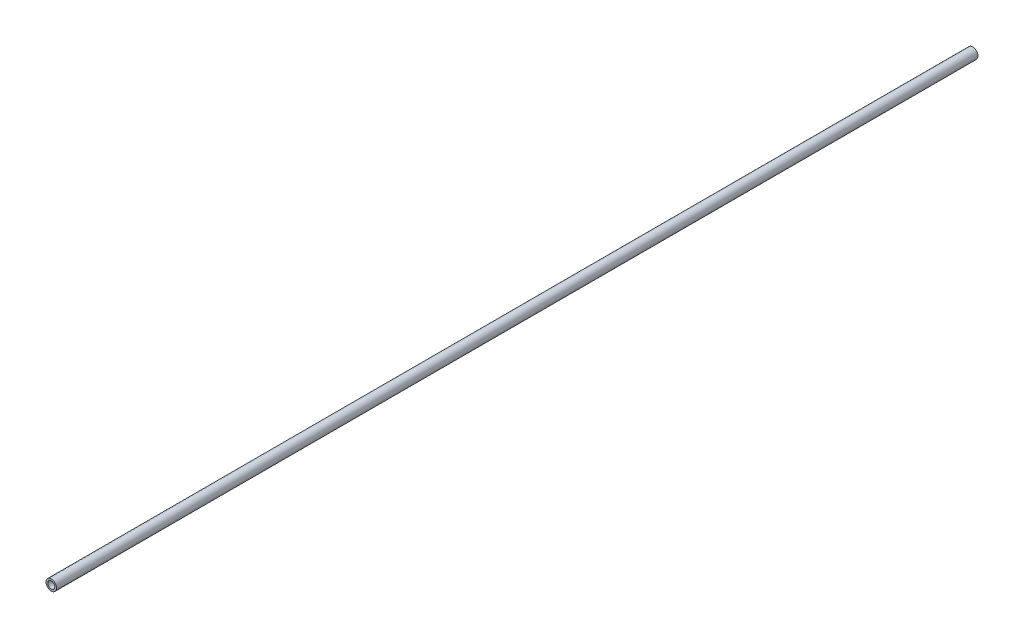
ISO-10303-21;
HEADER;
FILE_DESCRIPTION(('STEP AP214'),'2;1');
FILE_NAME('part.step','',(''),(''),'','','');
FILE_SCHEMA(('AUTOMOTIVE_DESIGN { 1 0 10303 214 1 1 1 1 }'));
ENDSEC;
DATA;
#1=APPLICATION_CONTEXT('core data for automotive mechanical design processes');
#2=APPLICATION_PROTOCOL_DEFINITION('international standard','automotive_design',2000,#1);
#3=PRODUCT_CONTEXT('',#1,'mechanical');
#4=PRODUCT('Part','Part','',(#3));
#5=PRODUCT_RELATED_PRODUCT_CATEGORY('part','',(#4));
#6=PRODUCT_DEFINITION_FORMATION('','',#4);
#7=PRODUCT_DEFINITION_CONTEXT('part definition',#1,'design');
#8=PRODUCT_DEFINITION('design','',#6,#7);
#9=PRODUCT_DEFINITION_SHAPE('','',#8);
#10=(LENGTH_UNIT() NAMED_UNIT(*) SI_UNIT(.MILLI.,.METRE.));
#11=(NAMED_UNIT(*) PLANE_ANGLE_UNIT() SI_UNIT($,.RADIAN.));
#12=(NAMED_UNIT(*) SI_UNIT($,.STERADIAN.) SOLID_ANGLE_UNIT());
#13=UNCERTAINTY_MEASURE_WITH_UNIT(LENGTH_MEASURE(1.E-05),#10,'distance_accuracy_value','');
#14=(GEOMETRIC_REPRESENTATION_CONTEXT(3) GLOBAL_UNCERTAINTY_ASSIGNED_CONTEXT((#13)) GLOBAL_UNIT_ASSIGNED_CONTEXT((#10,
#11,#12)) REPRESENTATION_CONTEXT('',''));
#15=CARTESIAN_POINT('',(0.,0.,0.));
#16=DIRECTION('',(0.,0.,1.));
#17=DIRECTION('',(1.,0.,0.));
#18=AXIS2_PLACEMENT_3D('',#15,#16,#17);
#19=CARTESIAN_POINT('',(0.,0.,1333.5));
#20=DIRECTION('',(0.,0.,1.));
#21=DIRECTION('',(1.,0.,0.));
#22=AXIS2_PLACEMENT_3D('',#19,#20,#21);
#23=PLANE('',#22);
#24=CARTESIAN_POINT('',(0.,0.,1333.5));
#25=DIRECTION('',(0.,0.,1.));
#26=DIRECTION('',(1.,0.,0.));
#27=AXIS2_PLACEMENT_3D('',#24,#25,#26);
#28=CIRCLE('',#27,7.62);
#29=CARTESIAN_POINT('',(7.62,0.,1333.5));
#30=VERTEX_POINT('',#29);
#31=EDGE_CURVE('E10',#30,#30,#28,.T.);
#32=ORIENTED_EDGE('',*,*,#31,.T.);
#33=EDGE_LOOP('',(#32));
#34=FACE_BOUND('',#33,.T.);
#35=CARTESIAN_POINT('',(0.,0.,1333.5));
#36=DIRECTION('',(0.,0.,1.));
#37=DIRECTION('',(1.,0.,0.));
#38=AXIS2_PLACEMENT_3D('',#35,#36,#37);
#39=CIRCLE('',#38,5.08);
#40=CARTESIAN_POINT('',(5.08,0.,1333.5));
#41=VERTEX_POINT('',#40);
#42=EDGE_CURVE('E43',#41,#41,#39,.T.);
#43=ORIENTED_EDGE('',*,*,#42,.F.);
#44=EDGE_LOOP('',(#43));
#45=FACE_BOUND('',#44,.T.);
#46=ADVANCED_FACE('F32',(#34,#45),#23,.T.);
#47=CARTESIAN_POINT('',(0.,0.,0.));
#48=DIRECTION('',(0.,0.,1.));
#49=DIRECTION('',(1.,0.,0.));
#50=AXIS2_PLACEMENT_3D('',#47,#48,#49);
#51=PLANE('',#50);
#52=CARTESIAN_POINT('',(0.,0.,0.));
#53=DIRECTION('',(0.,0.,1.));
#54=DIRECTION('',(1.,0.,0.));
#55=AXIS2_PLACEMENT_3D('',#52,#53,#54);
#56=CIRCLE('',#55,7.62);
#57=CARTESIAN_POINT('',(7.62,0.,0.));
#58=VERTEX_POINT('',#57);
#59=EDGE_CURVE('E36',#58,#58,#56,.T.);
#60=ORIENTED_EDGE('',*,*,#59,.F.);
#61=EDGE_LOOP('',(#60));
#62=FACE_BOUND('',#61,.T.);
#63=CARTESIAN_POINT('',(0.,0.,0.));
#64=DIRECTION('',(0.,0.,1.));
#65=DIRECTION('',(1.,0.,0.));
#66=AXIS2_PLACEMENT_3D('',#63,#64,#65);
#67=CIRCLE('',#66,5.08);
#68=CARTESIAN_POINT('',(5.08,0.,0.));
#69=VERTEX_POINT('',#68);
#70=EDGE_CURVE('E45',#69,#69,#67,.T.);
#71=ORIENTED_EDGE('',*,*,#70,.T.);
#72=EDGE_LOOP('',(#71));
#73=FACE_BOUND('',#72,.T.);
#74=ADVANCED_FACE('F55',(#62,#73),#51,.F.);
#75=CARTESIAN_POINT('',(0.,0.,1333.5));
#76=DIRECTION('',(0.,0.,-1.));
#77=DIRECTION('',(-1.,0.,0.));
#78=AXIS2_PLACEMENT_3D('',#75,#76,#77);
#79=CYLINDRICAL_SURFACE('',#78,7.62);
#80=ORIENTED_EDGE('',*,*,#31,.F.);
#81=EDGE_LOOP('',(#80));
#82=FACE_BOUND('',#81,.T.);
#83=ORIENTED_EDGE('',*,*,#59,.T.);
#84=EDGE_LOOP('',(#83));
#85=FACE_BOUND('',#84,.T.);
#86=ADVANCED_FACE('F34',(#82,#85),#79,.T.);
#87=CARTESIAN_POINT('',(0.,0.,1333.5));
#88=DIRECTION('',(0.,0.,-1.));
#89=DIRECTION('',(-1.,0.,0.));
#90=AXIS2_PLACEMENT_3D('',#87,#88,#89);
#91=CYLINDRICAL_SURFACE('',#90,5.08);
#92=ORIENTED_EDGE('',*,*,#42,.T.);
#93=EDGE_LOOP('',(#92));
#94=FACE_BOUND('',#93,.T.);
#95=ORIENTED_EDGE('',*,*,#70,.F.);
#96=EDGE_LOOP('',(#95));
#97=FACE_BOUND('',#96,.T.);
#98=ADVANCED_FACE('F51',(#94,#97),#91,.F.);
#99=CLOSED_SHELL('',(#46,#74,#86,#98));
#100=MANIFOLD_SOLID_BREP('B2',#99);
#101=ADVANCED_BREP_SHAPE_REPRESENTATION('',(#18,#100),#14);
#102=SHAPE_DEFINITION_REPRESENTATION(#9,#101);
ENDSEC;
END-ISO-10303-21;
